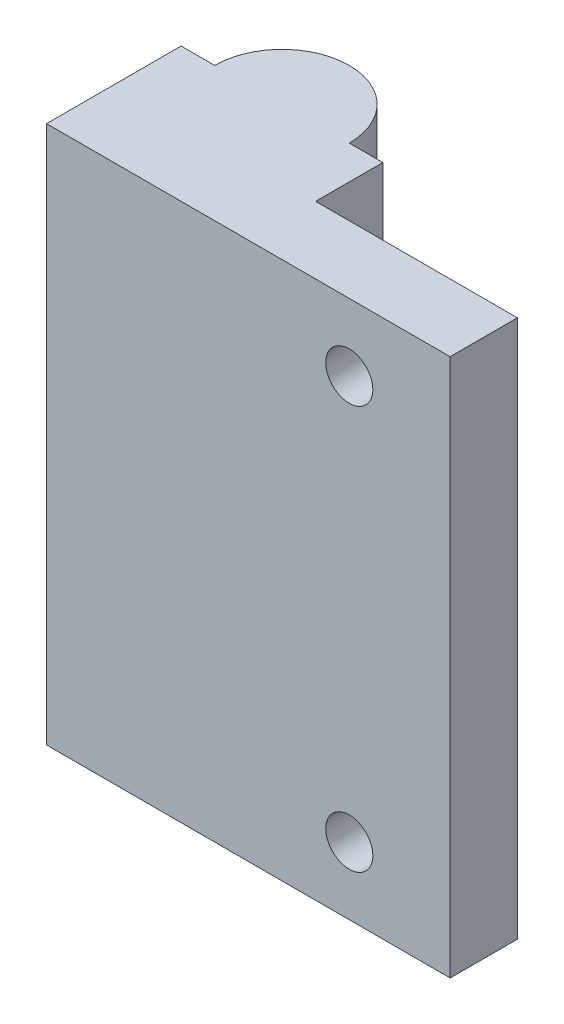
ISO-10303-21;
HEADER;
FILE_DESCRIPTION(('STEP AP214'),'2;1');
FILE_NAME('part.step','',(''),(''),'','','');
FILE_SCHEMA(('AUTOMOTIVE_DESIGN { 1 0 10303 214 1 1 1 1 }'));
ENDSEC;
DATA;
#1=APPLICATION_CONTEXT('core data for automotive mechanical design processes');
#2=APPLICATION_PROTOCOL_DEFINITION('international standard','automotive_design',2000,#1);
#3=PRODUCT_CONTEXT('',#1,'mechanical');
#4=PRODUCT('Part','Part','',(#3));
#5=PRODUCT_RELATED_PRODUCT_CATEGORY('part','',(#4));
#6=PRODUCT_DEFINITION_FORMATION('','',#4);
#7=PRODUCT_DEFINITION_CONTEXT('part definition',#1,'design');
#8=PRODUCT_DEFINITION('design','',#6,#7);
#9=PRODUCT_DEFINITION_SHAPE('','',#8);
#10=(LENGTH_UNIT() NAMED_UNIT(*) SI_UNIT(.MILLI.,.METRE.));
#11=(NAMED_UNIT(*) PLANE_ANGLE_UNIT() SI_UNIT($,.RADIAN.));
#12=(NAMED_UNIT(*) SI_UNIT($,.STERADIAN.) SOLID_ANGLE_UNIT());
#13=UNCERTAINTY_MEASURE_WITH_UNIT(LENGTH_MEASURE(1.E-05),#10,'distance_accuracy_value','');
#14=(GEOMETRIC_REPRESENTATION_CONTEXT(3) GLOBAL_UNCERTAINTY_ASSIGNED_CONTEXT((#13)) GLOBAL_UNIT_ASSIGNED_CONTEXT((#10,
#11,#12)) REPRESENTATION_CONTEXT('',''));
#15=CARTESIAN_POINT('',(0.,0.,0.));
#16=DIRECTION('',(0.,0.,1.));
#17=DIRECTION('',(1.,0.,0.));
#18=AXIS2_PLACEMENT_3D('',#15,#16,#17);
#19=CARTESIAN_POINT('',(0.,0.,0.));
#20=DIRECTION('',(0.,0.,-1.));
#21=DIRECTION('',(-1.,0.,0.));
#22=AXIS2_PLACEMENT_3D('',#19,#20,#21);
#23=PLANE('',#22);
#24=DIRECTION('',(0.,-1.,0.));
#25=VECTOR('',#24,1.);
#26=CARTESIAN_POINT('',(12.5,40.,0.));
#27=LINE('',#26,#25);
#28=CARTESIAN_POINT('',(12.5,40.,0.));
#29=VERTEX_POINT('',#28);
#30=CARTESIAN_POINT('',(12.5,0.,0.));
#31=VERTEX_POINT('',#30);
#32=EDGE_CURVE('E13',#29,#31,#27,.T.);
#33=ORIENTED_EDGE('',*,*,#32,.F.);
#34=DIRECTION('',(-1.,0.,0.));
#35=VECTOR('',#34,1.);
#36=CARTESIAN_POINT('',(0.,40.,0.));
#37=LINE('',#36,#35);
#38=CARTESIAN_POINT('',(15.,40.,0.));
#39=VERTEX_POINT('',#38);
#40=EDGE_CURVE('E126',#39,#29,#37,.T.);
#41=ORIENTED_EDGE('',*,*,#40,.F.);
#42=DIRECTION('',(0.,1.,0.));
#43=VECTOR('',#42,1.);
#44=CARTESIAN_POINT('',(15.,0.,0.));
#45=LINE('',#44,#43);
#46=CARTESIAN_POINT('',(15.,0.,0.));
#47=VERTEX_POINT('',#46);
#48=EDGE_CURVE('E164',#47,#39,#45,.T.);
#49=ORIENTED_EDGE('',*,*,#48,.F.);
#50=DIRECTION('',(1.,0.,0.));
#51=VECTOR('',#50,1.);
#52=CARTESIAN_POINT('',(0.,0.,0.));
#53=LINE('',#52,#51);
#54=EDGE_CURVE('E64',#31,#47,#53,.T.);
#55=ORIENTED_EDGE('',*,*,#54,.F.);
#56=EDGE_LOOP('',(#33,#41,#49,#55));
#57=FACE_BOUND('',#56,.T.);
#58=ADVANCED_FACE('F45',(#57),#23,.T.);
#59=CARTESIAN_POINT('',(0.,0.,10.));
#60=DIRECTION('',(1.,0.,0.));
#61=DIRECTION('',(0.,0.,-1.));
#62=AXIS2_PLACEMENT_3D('',#59,#60,#61);
#63=PLANE('',#62);
#64=DIRECTION('',(0.,-1.,0.));
#65=VECTOR('',#64,1.);
#66=CARTESIAN_POINT('',(0.,0.,0.));
#67=LINE('',#66,#65);
#68=CARTESIAN_POINT('',(0.,40.,0.));
#69=VERTEX_POINT('',#68);
#70=CARTESIAN_POINT('',(0.,0.,0.));
#71=VERTEX_POINT('',#70);
#72=EDGE_CURVE('E128',#69,#71,#67,.T.);
#73=ORIENTED_EDGE('',*,*,#72,.T.);
#74=DIRECTION('',(0.,0.,-1.));
#75=VECTOR('',#74,1.);
#76=CARTESIAN_POINT('',(0.,0.,10.));
#77=LINE('',#76,#75);
#78=CARTESIAN_POINT('',(0.,0.,10.));
#79=VERTEX_POINT('',#78);
#80=EDGE_CURVE('E121',#79,#71,#77,.T.);
#81=ORIENTED_EDGE('',*,*,#80,.F.);
#82=DIRECTION('',(0.,-1.,0.));
#83=VECTOR('',#82,1.);
#84=CARTESIAN_POINT('',(0.,0.,10.));
#85=LINE('',#84,#83);
#86=CARTESIAN_POINT('',(0.,40.,10.));
#87=VERTEX_POINT('',#86);
#88=EDGE_CURVE('E133',#87,#79,#85,.T.);
#89=ORIENTED_EDGE('',*,*,#88,.F.);
#90=DIRECTION('',(0.,0.,-1.));
#91=VECTOR('',#90,1.);
#92=CARTESIAN_POINT('',(0.,40.,10.));
#93=LINE('',#92,#91);
#94=EDGE_CURVE('E134',#87,#69,#93,.T.);
#95=ORIENTED_EDGE('',*,*,#94,.T.);
#96=EDGE_LOOP('',(#73,#81,#89,#95));
#97=FACE_BOUND('',#96,.T.);
#98=ADVANCED_FACE('F47',(#97),#63,.F.);
#99=CARTESIAN_POINT('',(0.,0.,10.));
#100=DIRECTION('',(0.,1.,0.));
#101=DIRECTION('',(0.,0.,1.));
#102=AXIS2_PLACEMENT_3D('',#99,#100,#101);
#103=PLANE('',#102);
#104=CARTESIAN_POINT('',(7.5,0.,0.));
#105=DIRECTION('',(0.,-1.,0.));
#106=DIRECTION('',(0.,0.,-1.));
#107=AXIS2_PLACEMENT_3D('',#104,#105,#106);
#108=CIRCLE('',#107,3.5);
#109=CARTESIAN_POINT('',(7.5,0.,-3.5));
#110=VERTEX_POINT('',#109);
#111=EDGE_CURVE('E237',#110,#110,#108,.T.);
#112=ORIENTED_EDGE('',*,*,#111,.F.);
#113=EDGE_LOOP('',(#112));
#114=FACE_BOUND('',#113,.T.);
#115=CARTESIAN_POINT('',(2.5,0.,0.));
#116=VERTEX_POINT('',#115);
#117=EDGE_CURVE('E118',#71,#116,#53,.T.);
#118=ORIENTED_EDGE('',*,*,#117,.T.);
#119=CARTESIAN_POINT('',(7.5,0.,0.));
#120=DIRECTION('',(0.,-1.,0.));
#121=DIRECTION('',(0.,0.,-1.));
#122=AXIS2_PLACEMENT_3D('',#119,#120,#121);
#123=CIRCLE('',#122,5.);
#124=EDGE_CURVE('E60',#116,#31,#123,.T.);
#125=ORIENTED_EDGE('',*,*,#124,.T.);
#126=ORIENTED_EDGE('',*,*,#54,.T.);
#127=DIRECTION('',(0.,0.,-1.));
#128=VECTOR('',#127,1.);
#129=CARTESIAN_POINT('',(15.,0.,5.));
#130=LINE('',#129,#128);
#131=CARTESIAN_POINT('',(15.,0.,5.));
#132=VERTEX_POINT('',#131);
#133=EDGE_CURVE('E157',#132,#47,#130,.T.);
#134=ORIENTED_EDGE('',*,*,#133,.F.);
#135=DIRECTION('',(-1.,0.,0.));
#136=VECTOR('',#135,1.);
#137=CARTESIAN_POINT('',(30.,0.,5.));
#138=LINE('',#137,#136);
#139=CARTESIAN_POINT('',(30.,0.,5.));
#140=VERTEX_POINT('',#139);
#141=EDGE_CURVE('E156',#140,#132,#138,.T.);
#142=ORIENTED_EDGE('',*,*,#141,.F.);
#143=DIRECTION('',(0.,0.,-1.));
#144=VECTOR('',#143,1.);
#145=CARTESIAN_POINT('',(30.,0.,10.));
#146=LINE('',#145,#144);
#147=CARTESIAN_POINT('',(30.,0.,10.));
#148=VERTEX_POINT('',#147);
#149=EDGE_CURVE('E141',#148,#140,#146,.T.);
#150=ORIENTED_EDGE('',*,*,#149,.F.);
#151=DIRECTION('',(1.,0.,0.));
#152=VECTOR('',#151,1.);
#153=CARTESIAN_POINT('',(0.,0.,10.));
#154=LINE('',#153,#152);
#155=EDGE_CURVE('E153',#79,#148,#154,.T.);
#156=ORIENTED_EDGE('',*,*,#155,.F.);
#157=ORIENTED_EDGE('',*,*,#80,.T.);
#158=EDGE_LOOP('',(#118,#125,#126,#134,#142,#150,#156,#157));
#159=FACE_BOUND('',#158,.T.);
#160=ADVANCED_FACE('F122',(#114,#159),#103,.F.);
#161=CARTESIAN_POINT('',(30.,0.,10.));
#162=DIRECTION('',(-1.,0.,0.));
#163=DIRECTION('',(0.,0.,1.));
#164=AXIS2_PLACEMENT_3D('',#161,#162,#163);
#165=PLANE('',#164);
#166=ORIENTED_EDGE('',*,*,#149,.T.);
#167=DIRECTION('',(0.,-1.,0.));
#168=VECTOR('',#167,1.);
#169=CARTESIAN_POINT('',(30.,0.,5.));
#170=LINE('',#169,#168);
#171=CARTESIAN_POINT('',(30.,40.,5.));
#172=VERTEX_POINT('',#171);
#173=EDGE_CURVE('E150',#172,#140,#170,.T.);
#174=ORIENTED_EDGE('',*,*,#173,.F.);
#175=DIRECTION('',(0.,0.,-1.));
#176=VECTOR('',#175,1.);
#177=CARTESIAN_POINT('',(30.,40.,10.));
#178=LINE('',#177,#176);
#179=CARTESIAN_POINT('',(30.,40.,10.));
#180=VERTEX_POINT('',#179);
#181=EDGE_CURVE('E137',#180,#172,#178,.T.);
#182=ORIENTED_EDGE('',*,*,#181,.F.);
#183=DIRECTION('',(0.,1.,0.));
#184=VECTOR('',#183,1.);
#185=CARTESIAN_POINT('',(30.,0.,10.));
#186=LINE('',#185,#184);
#187=EDGE_CURVE('E151',#148,#180,#186,.T.);
#188=ORIENTED_EDGE('',*,*,#187,.F.);
#189=EDGE_LOOP('',(#166,#174,#182,#188));
#190=FACE_BOUND('',#189,.T.);
#191=ADVANCED_FACE('F148',(#190),#165,.F.);
#192=CARTESIAN_POINT('',(0.,40.,10.));
#193=DIRECTION('',(0.,-1.,0.));
#194=DIRECTION('',(0.,0.,-1.));
#195=AXIS2_PLACEMENT_3D('',#192,#193,#194);
#196=PLANE('',#195);
#197=ORIENTED_EDGE('',*,*,#40,.T.);
#198=CARTESIAN_POINT('',(7.5,40.,0.));
#199=DIRECTION('',(0.,-1.,0.));
#200=DIRECTION('',(0.,0.,-1.));
#201=AXIS2_PLACEMENT_3D('',#198,#199,#200);
#202=CIRCLE('',#201,5.);
#203=CARTESIAN_POINT('',(2.5,40.,0.));
#204=VERTEX_POINT('',#203);
#205=EDGE_CURVE('E111',#204,#29,#202,.T.);
#206=ORIENTED_EDGE('',*,*,#205,.F.);
#207=EDGE_CURVE('E120',#204,#69,#37,.T.);
#208=ORIENTED_EDGE('',*,*,#207,.T.);
#209=ORIENTED_EDGE('',*,*,#94,.F.);
#210=DIRECTION('',(-1.,0.,0.));
#211=VECTOR('',#210,1.);
#212=CARTESIAN_POINT('',(0.,40.,10.));
#213=LINE('',#212,#211);
#214=EDGE_CURVE('E138',#180,#87,#213,.T.);
#215=ORIENTED_EDGE('',*,*,#214,.F.);
#216=ORIENTED_EDGE('',*,*,#181,.T.);
#217=DIRECTION('',(1.,0.,0.));
#218=VECTOR('',#217,1.);
#219=CARTESIAN_POINT('',(30.,40.,5.));
#220=LINE('',#219,#218);
#221=CARTESIAN_POINT('',(15.,40.,5.));
#222=VERTEX_POINT('',#221);
#223=EDGE_CURVE('E162',#222,#172,#220,.T.);
#224=ORIENTED_EDGE('',*,*,#223,.F.);
#225=DIRECTION('',(0.,0.,-1.));
#226=VECTOR('',#225,1.);
#227=CARTESIAN_POINT('',(15.,40.,5.));
#228=LINE('',#227,#226);
#229=EDGE_CURVE('E171',#222,#39,#228,.T.);
#230=ORIENTED_EDGE('',*,*,#229,.T.);
#231=EDGE_LOOP('',(#197,#206,#208,#209,#215,#216,#224,#230));
#232=FACE_BOUND('',#231,.T.);
#233=ADVANCED_FACE('F183',(#232),#196,.F.);
#234=CARTESIAN_POINT('',(0.,0.,10.));
#235=DIRECTION('',(0.,0.,-1.));
#236=DIRECTION('',(-1.,0.,0.));
#237=AXIS2_PLACEMENT_3D('',#234,#235,#236);
#238=PLANE('',#237);
#239=CARTESIAN_POINT('',(22.5,35.,10.));
#240=DIRECTION('',(0.,0.,-1.));
#241=DIRECTION('',(-1.,0.,0.));
#242=AXIS2_PLACEMENT_3D('',#239,#240,#241);
#243=CIRCLE('',#242,1.75);
#244=CARTESIAN_POINT('',(20.75,35.,10.));
#245=VERTEX_POINT('',#244);
#246=EDGE_CURVE('E246',#245,#245,#243,.T.);
#247=ORIENTED_EDGE('',*,*,#246,.T.);
#248=EDGE_LOOP('',(#247));
#249=FACE_BOUND('',#248,.T.);
#250=CARTESIAN_POINT('',(22.5,5.,10.));
#251=DIRECTION('',(0.,0.,-1.));
#252=DIRECTION('',(-1.,0.,0.));
#253=AXIS2_PLACEMENT_3D('',#250,#251,#252);
#254=CIRCLE('',#253,1.75);
#255=CARTESIAN_POINT('',(20.75,5.,10.));
#256=VERTEX_POINT('',#255);
#257=EDGE_CURVE('E170',#256,#256,#254,.T.);
#258=ORIENTED_EDGE('',*,*,#257,.T.);
#259=EDGE_LOOP('',(#258));
#260=FACE_BOUND('',#259,.T.);
#261=ORIENTED_EDGE('',*,*,#88,.T.);
#262=ORIENTED_EDGE('',*,*,#155,.T.);
#263=ORIENTED_EDGE('',*,*,#187,.T.);
#264=ORIENTED_EDGE('',*,*,#214,.T.);
#265=EDGE_LOOP('',(#261,#262,#263,#264));
#266=FACE_BOUND('',#265,.T.);
#267=ADVANCED_FACE('F180',(#249,#260,#266),#238,.F.);
#268=DIRECTION('',(0.,-1.,0.));
#269=VECTOR('',#268,1.);
#270=CARTESIAN_POINT('',(2.5,40.,0.));
#271=LINE('',#270,#269);
#272=EDGE_CURVE('E53',#116,#204,#271,.F.);
#273=ORIENTED_EDGE('',*,*,#272,.F.);
#274=ORIENTED_EDGE('',*,*,#117,.F.);
#275=ORIENTED_EDGE('',*,*,#72,.F.);
#276=ORIENTED_EDGE('',*,*,#207,.F.);
#277=EDGE_LOOP('',(#273,#274,#275,#276));
#278=FACE_BOUND('',#277,.T.);
#279=ADVANCED_FACE('F116',(#278),#23,.T.);
#280=CARTESIAN_POINT('',(15.,0.,5.));
#281=DIRECTION('',(-1.,0.,0.));
#282=DIRECTION('',(0.,0.,1.));
#283=AXIS2_PLACEMENT_3D('',#280,#281,#282);
#284=PLANE('',#283);
#285=ORIENTED_EDGE('',*,*,#48,.T.);
#286=ORIENTED_EDGE('',*,*,#229,.F.);
#287=DIRECTION('',(0.,1.,0.));
#288=VECTOR('',#287,1.);
#289=CARTESIAN_POINT('',(15.,0.,5.));
#290=LINE('',#289,#288);
#291=EDGE_CURVE('E160',#132,#222,#290,.T.);
#292=ORIENTED_EDGE('',*,*,#291,.F.);
#293=ORIENTED_EDGE('',*,*,#133,.T.);
#294=EDGE_LOOP('',(#285,#286,#292,#293));
#295=FACE_BOUND('',#294,.T.);
#296=ADVANCED_FACE('F198',(#295),#284,.F.);
#297=CARTESIAN_POINT('',(0.,0.,5.));
#298=DIRECTION('',(0.,0.,1.));
#299=DIRECTION('',(1.,0.,0.));
#300=AXIS2_PLACEMENT_3D('',#297,#298,#299);
#301=PLANE('',#300);
#302=CARTESIAN_POINT('',(22.5,35.,5.));
#303=DIRECTION('',(0.,0.,-1.));
#304=DIRECTION('',(1.,0.,0.));
#305=AXIS2_PLACEMENT_3D('',#302,#303,#304);
#306=CIRCLE('',#305,1.75);
#307=CARTESIAN_POINT('',(24.25,35.,5.));
#308=VERTEX_POINT('',#307);
#309=EDGE_CURVE('E242',#308,#308,#306,.T.);
#310=ORIENTED_EDGE('',*,*,#309,.F.);
#311=EDGE_LOOP('',(#310));
#312=FACE_BOUND('',#311,.T.);
#313=CARTESIAN_POINT('',(22.5,5.,5.));
#314=DIRECTION('',(0.,0.,-1.));
#315=DIRECTION('',(-1.,0.,0.));
#316=AXIS2_PLACEMENT_3D('',#313,#314,#315);
#317=CIRCLE('',#316,1.75);
#318=CARTESIAN_POINT('',(20.75,5.,5.));
#319=VERTEX_POINT('',#318);
#320=EDGE_CURVE('E248',#319,#319,#317,.T.);
#321=ORIENTED_EDGE('',*,*,#320,.F.);
#322=EDGE_LOOP('',(#321));
#323=FACE_BOUND('',#322,.T.);
#324=ORIENTED_EDGE('',*,*,#173,.T.);
#325=ORIENTED_EDGE('',*,*,#141,.T.);
#326=ORIENTED_EDGE('',*,*,#291,.T.);
#327=ORIENTED_EDGE('',*,*,#223,.T.);
#328=EDGE_LOOP('',(#324,#325,#326,#327));
#329=FACE_BOUND('',#328,.T.);
#330=ADVANCED_FACE('F203',(#312,#323,#329),#301,.F.);
#331=CARTESIAN_POINT('',(22.5,5.,35.));
#332=DIRECTION('',(0.,0.,-1.));
#333=DIRECTION('',(-1.,0.,0.));
#334=AXIS2_PLACEMENT_3D('',#331,#332,#333);
#335=CYLINDRICAL_SURFACE('',#334,1.75);
#336=ORIENTED_EDGE('',*,*,#320,.T.);
#337=EDGE_LOOP('',(#336));
#338=FACE_BOUND('',#337,.T.);
#339=ORIENTED_EDGE('',*,*,#257,.F.);
#340=EDGE_LOOP('',(#339));
#341=FACE_BOUND('',#340,.T.);
#342=ADVANCED_FACE('F215',(#338,#341),#335,.F.);
#343=CARTESIAN_POINT('',(22.5,35.,35.));
#344=DIRECTION('',(0.,0.,-1.));
#345=DIRECTION('',(-1.,0.,0.));
#346=AXIS2_PLACEMENT_3D('',#343,#344,#345);
#347=CYLINDRICAL_SURFACE('',#346,1.75);
#348=ORIENTED_EDGE('',*,*,#309,.T.);
#349=EDGE_LOOP('',(#348));
#350=FACE_BOUND('',#349,.T.);
#351=ORIENTED_EDGE('',*,*,#246,.F.);
#352=EDGE_LOOP('',(#351));
#353=FACE_BOUND('',#352,.T.);
#354=ADVANCED_FACE('F219',(#350,#353),#347,.F.);
#355=CARTESIAN_POINT('',(7.5,40.,0.));
#356=DIRECTION('',(0.,-1.,0.));
#357=DIRECTION('',(0.,0.,-1.));
#358=AXIS2_PLACEMENT_3D('',#355,#356,#357);
#359=CYLINDRICAL_SURFACE('',#358,5.);
#360=ORIENTED_EDGE('',*,*,#205,.T.);
#361=ORIENTED_EDGE('',*,*,#32,.T.);
#362=ORIENTED_EDGE('',*,*,#124,.F.);
#363=ORIENTED_EDGE('',*,*,#272,.T.);
#364=EDGE_LOOP('',(#360,#361,#362,#363));
#365=FACE_BOUND('',#364,.T.);
#366=ADVANCED_FACE('F108',(#365),#359,.T.);
#367=CARTESIAN_POINT('',(7.5,30.,0.));
#368=DIRECTION('',(0.,-1.,0.));
#369=DIRECTION('',(0.,0.,-1.));
#370=AXIS2_PLACEMENT_3D('',#367,#368,#369);
#371=CYLINDRICAL_SURFACE('',#370,3.5);
#372=CARTESIAN_POINT('',(7.5,30.,0.));
#373=DIRECTION('',(0.,-1.,0.));
#374=DIRECTION('',(0.,0.,-1.));
#375=AXIS2_PLACEMENT_3D('',#372,#373,#374);
#376=CIRCLE('',#375,3.5);
#377=CARTESIAN_POINT('',(7.5,30.,-3.5));
#378=VERTEX_POINT('',#377);
#379=EDGE_CURVE('E112',#378,#378,#376,.T.);
#380=ORIENTED_EDGE('',*,*,#379,.F.);
#381=EDGE_LOOP('',(#380));
#382=FACE_BOUND('',#381,.T.);
#383=ORIENTED_EDGE('',*,*,#111,.T.);
#384=EDGE_LOOP('',(#383));
#385=FACE_BOUND('',#384,.T.);
#386=ADVANCED_FACE('F226',(#382,#385),#371,.F.);
#387=CARTESIAN_POINT('',(7.5,30.,0.));
#388=DIRECTION('',(0.,-1.,0.));
#389=DIRECTION('',(0.,0.,-1.));
#390=AXIS2_PLACEMENT_3D('',#387,#388,#389);
#391=PLANE('',#390);
#392=ORIENTED_EDGE('',*,*,#379,.T.);
#393=EDGE_LOOP('',(#392));
#394=FACE_BOUND('',#393,.T.);
#395=ADVANCED_FACE('F229',(#394),#391,.T.);
#396=CLOSED_SHELL('',(#58,#98,#160,#191,#233,#267,#279,#296,#330,#342,#354,#366,#386,#395));
#397=MANIFOLD_SOLID_BREP('B2',#396);
#398=ADVANCED_BREP_SHAPE_REPRESENTATION('',(#18,#397),#14);
#399=SHAPE_DEFINITION_REPRESENTATION(#9,#398);
ENDSEC;
END-ISO-10303-21;
